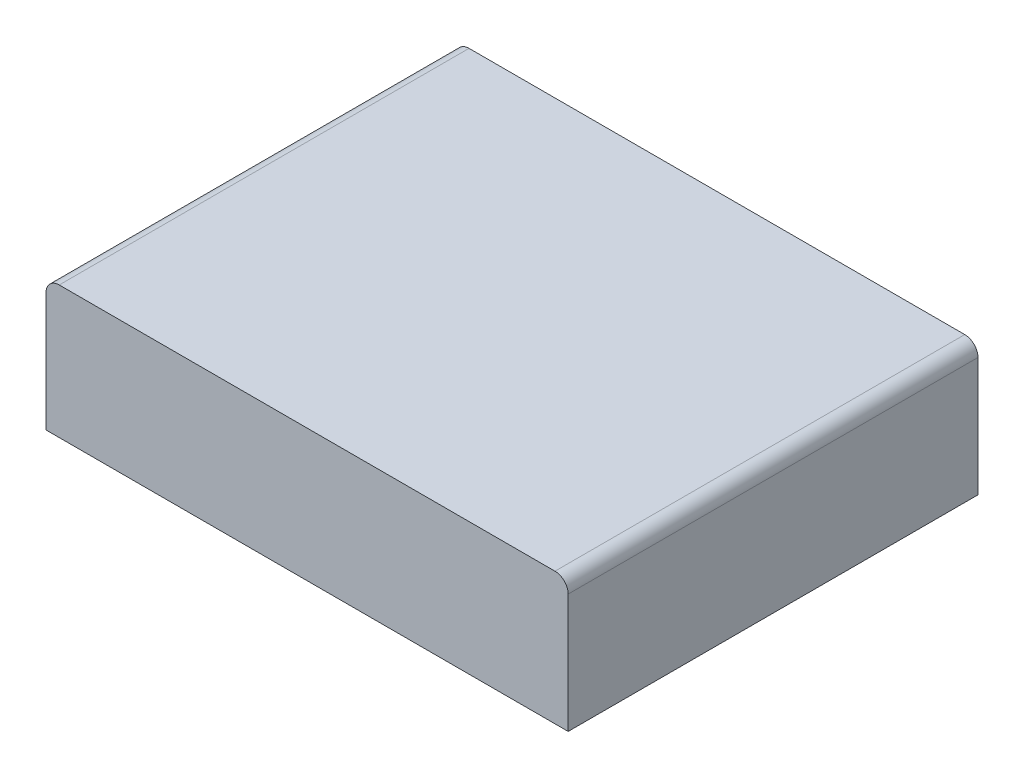
ISO-10303-21;
HEADER;
FILE_DESCRIPTION(('STEP AP214'),'2;1');
FILE_NAME('part.step','',(''),(''),'','','');
FILE_SCHEMA(('AUTOMOTIVE_DESIGN { 1 0 10303 214 1 1 1 1 }'));
ENDSEC;
DATA;
#1=APPLICATION_CONTEXT('core data for automotive mechanical design processes');
#2=APPLICATION_PROTOCOL_DEFINITION('international standard','automotive_design',2000,#1);
#3=PRODUCT_CONTEXT('',#1,'mechanical');
#4=PRODUCT('Part','Part','',(#3));
#5=PRODUCT_RELATED_PRODUCT_CATEGORY('part','',(#4));
#6=PRODUCT_DEFINITION_FORMATION('','',#4);
#7=PRODUCT_DEFINITION_CONTEXT('part definition',#1,'design');
#8=PRODUCT_DEFINITION('design','',#6,#7);
#9=PRODUCT_DEFINITION_SHAPE('','',#8);
#10=(LENGTH_UNIT() NAMED_UNIT(*) SI_UNIT(.MILLI.,.METRE.));
#11=(NAMED_UNIT(*) PLANE_ANGLE_UNIT() SI_UNIT($,.RADIAN.));
#12=(NAMED_UNIT(*) SI_UNIT($,.STERADIAN.) SOLID_ANGLE_UNIT());
#13=UNCERTAINTY_MEASURE_WITH_UNIT(LENGTH_MEASURE(1.E-05),#10,'distance_accuracy_value','');
#14=(GEOMETRIC_REPRESENTATION_CONTEXT(3) GLOBAL_UNCERTAINTY_ASSIGNED_CONTEXT((#13)) GLOBAL_UNIT_ASSIGNED_CONTEXT((#10,
#11,#12)) REPRESENTATION_CONTEXT('',''));
#15=CARTESIAN_POINT('',(0.,0.,0.));
#16=DIRECTION('',(0.,0.,1.));
#17=DIRECTION('',(1.,0.,0.));
#18=AXIS2_PLACEMENT_3D('',#15,#16,#17);
#19=CARTESIAN_POINT('',(5.64322874991416,39.1976983767566,241.582925809299));
#20=DIRECTION('',(0.,0.,1.));
#21=DIRECTION('',(1.,0.,0.));
#22=AXIS2_PLACEMENT_3D('',#19,#20,#21);
#23=CYLINDRICAL_SURFACE('',#22,0.0508);
#24=CARTESIAN_POINT('',(5.64322874991416,39.1976983767566,240.795525809299));
#25=DIRECTION('',(0.,0.,1.));
#26=DIRECTION('',(1.,0.,0.));
#27=AXIS2_PLACEMENT_3D('',#24,#25,#26);
#28=CIRCLE('',#27,0.0508);
#29=CARTESIAN_POINT('',(5.64322874991416,39.2484983767566,240.795525809299));
#30=VERTEX_POINT('',#29);
#31=CARTESIAN_POINT('',(5.59242874991414,39.1976983767566,240.795525809299));
#32=VERTEX_POINT('',#31);
#33=EDGE_CURVE('E126',#30,#32,#28,.T.);
#34=ORIENTED_EDGE('',*,*,#33,.T.);
#35=DIRECTION('',(0.,0.,-1.));
#36=VECTOR('',#35,1.);
#37=CARTESIAN_POINT('',(5.59242874991414,39.1976983767566,242.370325809298));
#38=LINE('',#37,#36);
#39=CARTESIAN_POINT('',(5.59242874991414,39.1976983767566,242.370325809298));
#40=VERTEX_POINT('',#39);
#41=EDGE_CURVE('E108',#32,#40,#38,.F.);
#42=ORIENTED_EDGE('',*,*,#41,.T.);
#43=CARTESIAN_POINT('',(5.64322874991416,39.1976983767566,242.370325809298));
#44=DIRECTION('',(0.,0.,1.));
#45=DIRECTION('',(1.,0.,0.));
#46=AXIS2_PLACEMENT_3D('',#43,#44,#45);
#47=CIRCLE('',#46,0.0508);
#48=CARTESIAN_POINT('',(5.64322874991416,39.2484983767566,242.370325809298));
#49=VERTEX_POINT('',#48);
#50=EDGE_CURVE('E20',#40,#49,#47,.F.);
#51=ORIENTED_EDGE('',*,*,#50,.T.);
#52=DIRECTION('',(0.,0.,-1.));
#53=VECTOR('',#52,1.);
#54=CARTESIAN_POINT('',(5.64322874991416,39.2484983767566,241.582925809299));
#55=LINE('',#54,#53);
#56=EDGE_CURVE('E104',#49,#30,#55,.T.);
#57=ORIENTED_EDGE('',*,*,#56,.T.);
#58=EDGE_LOOP('',(#34,#42,#51,#57));
#59=FACE_BOUND('',#58,.T.);
#60=ADVANCED_FACE('F17',(#59),#23,.T.);
#61=CARTESIAN_POINT('',(7.54822874991415,39.1976983767566,241.582925809299));
#62=DIRECTION('',(0.,0.,-1.));
#63=DIRECTION('',(-1.,0.,0.));
#64=AXIS2_PLACEMENT_3D('',#61,#62,#63);
#65=CYLINDRICAL_SURFACE('',#64,0.0508);
#66=CARTESIAN_POINT('',(7.54822874991415,39.1976983767566,242.370325809298));
#67=DIRECTION('',(0.,0.,-1.));
#68=DIRECTION('',(-1.,0.,0.));
#69=AXIS2_PLACEMENT_3D('',#66,#67,#68);
#70=CIRCLE('',#69,0.0508);
#71=CARTESIAN_POINT('',(7.54822874991415,39.2484983767566,242.370325809298));
#72=VERTEX_POINT('',#71);
#73=CARTESIAN_POINT('',(7.59902874991417,39.1976983767566,242.370325809298));
#74=VERTEX_POINT('',#73);
#75=EDGE_CURVE('E113',#72,#74,#70,.T.);
#76=ORIENTED_EDGE('',*,*,#75,.T.);
#77=DIRECTION('',(0.,0.,1.));
#78=VECTOR('',#77,1.);
#79=CARTESIAN_POINT('',(7.59902874991417,39.1976983767566,242.370325809298));
#80=LINE('',#79,#78);
#81=CARTESIAN_POINT('',(7.59902874991417,39.1976983767566,240.795525809299));
#82=VERTEX_POINT('',#81);
#83=EDGE_CURVE('E100',#74,#82,#80,.F.);
#84=ORIENTED_EDGE('',*,*,#83,.T.);
#85=CARTESIAN_POINT('',(7.54822874991415,39.1976983767566,240.795525809299));
#86=DIRECTION('',(0.,0.,-1.));
#87=DIRECTION('',(-1.,0.,0.));
#88=AXIS2_PLACEMENT_3D('',#85,#86,#87);
#89=CIRCLE('',#88,0.0508);
#90=CARTESIAN_POINT('',(7.54822874991415,39.2484983767566,240.795525809299));
#91=VERTEX_POINT('',#90);
#92=EDGE_CURVE('E122',#82,#91,#89,.F.);
#93=ORIENTED_EDGE('',*,*,#92,.T.);
#94=DIRECTION('',(0.,0.,-1.));
#95=VECTOR('',#94,1.);
#96=CARTESIAN_POINT('',(7.54822874991415,39.2484983767566,241.582925809299));
#97=LINE('',#96,#95);
#98=EDGE_CURVE('E109',#91,#72,#97,.F.);
#99=ORIENTED_EDGE('',*,*,#98,.T.);
#100=EDGE_LOOP('',(#76,#84,#93,#99));
#101=FACE_BOUND('',#100,.T.);
#102=ADVANCED_FACE('F161',(#101),#65,.T.);
#103=CARTESIAN_POINT('',(6.59572874991415,39.2484983767566,241.582925809299));
#104=DIRECTION('',(0.,-1.,0.));
#105=DIRECTION('',(0.,0.,-1.));
#106=AXIS2_PLACEMENT_3D('',#103,#104,#105);
#107=PLANE('',#106);
#108=DIRECTION('',(-1.,0.,0.));
#109=VECTOR('',#108,1.);
#110=CARTESIAN_POINT('',(5.59242874991414,39.2484983767566,242.370325809298));
#111=LINE('',#110,#109);
#112=EDGE_CURVE('E136',#49,#72,#111,.F.);
#113=ORIENTED_EDGE('',*,*,#112,.T.);
#114=ORIENTED_EDGE('',*,*,#98,.F.);
#115=DIRECTION('',(1.,0.,0.));
#116=VECTOR('',#115,1.);
#117=CARTESIAN_POINT('',(5.59242874991414,39.2484983767566,240.795525809299));
#118=LINE('',#117,#116);
#119=EDGE_CURVE('E117',#91,#30,#118,.F.);
#120=ORIENTED_EDGE('',*,*,#119,.T.);
#121=ORIENTED_EDGE('',*,*,#56,.F.);
#122=EDGE_LOOP('',(#113,#114,#120,#121));
#123=FACE_BOUND('',#122,.T.);
#124=ADVANCED_FACE('F134',(#123),#107,.F.);
#125=CARTESIAN_POINT('',(5.59242874991414,39.2484983767566,242.370325809298));
#126=DIRECTION('',(1.,0.,0.));
#127=DIRECTION('',(0.,0.,-1.));
#128=AXIS2_PLACEMENT_3D('',#125,#126,#127);
#129=PLANE('',#128);
#130=DIRECTION('',(0.,1.,0.));
#131=VECTOR('',#130,1.);
#132=CARTESIAN_POINT('',(5.59242874991414,39.2484983767566,240.795525809299));
#133=LINE('',#132,#131);
#134=CARTESIAN_POINT('',(5.59242874991414,38.7404983767566,240.795525809299));
#135=VERTEX_POINT('',#134);
#136=EDGE_CURVE('E79',#32,#135,#133,.F.);
#137=ORIENTED_EDGE('',*,*,#136,.T.);
#138=DIRECTION('',(0.,0.,-1.));
#139=VECTOR('',#138,1.);
#140=CARTESIAN_POINT('',(5.59242874991414,38.7404983767566,241.582925809299));
#141=LINE('',#140,#139);
#142=CARTESIAN_POINT('',(5.59242874991414,38.7404983767566,242.370325809298));
#143=VERTEX_POINT('',#142);
#144=EDGE_CURVE('E74',#143,#135,#141,.T.);
#145=ORIENTED_EDGE('',*,*,#144,.F.);
#146=DIRECTION('',(0.,1.,0.));
#147=VECTOR('',#146,1.);
#148=CARTESIAN_POINT('',(5.59242874991414,39.2484983767566,242.370325809298));
#149=LINE('',#148,#147);
#150=EDGE_CURVE('E77',#143,#40,#149,.T.);
#151=ORIENTED_EDGE('',*,*,#150,.T.);
#152=ORIENTED_EDGE('',*,*,#41,.F.);
#153=EDGE_LOOP('',(#137,#145,#151,#152));
#154=FACE_BOUND('',#153,.T.);
#155=ADVANCED_FACE('F75',(#154),#129,.F.);
#156=CARTESIAN_POINT('',(5.59242874991414,39.2484983767566,240.795525809299));
#157=DIRECTION('',(0.,0.,1.));
#158=DIRECTION('',(1.,0.,0.));
#159=AXIS2_PLACEMENT_3D('',#156,#157,#158);
#160=PLANE('',#159);
#161=ORIENTED_EDGE('',*,*,#119,.F.);
#162=ORIENTED_EDGE('',*,*,#92,.F.);
#163=DIRECTION('',(0.,1.,0.));
#164=VECTOR('',#163,1.);
#165=CARTESIAN_POINT('',(7.59902874991417,39.2484983767566,240.795525809299));
#166=LINE('',#165,#164);
#167=CARTESIAN_POINT('',(7.59902874991417,38.7404983767566,240.795525809299));
#168=VERTEX_POINT('',#167);
#169=EDGE_CURVE('E114',#82,#168,#166,.F.);
#170=ORIENTED_EDGE('',*,*,#169,.T.);
#171=DIRECTION('',(1.,0.,0.));
#172=VECTOR('',#171,1.);
#173=CARTESIAN_POINT('',(6.59572874991415,38.7404983767566,240.795525809299));
#174=LINE('',#173,#172);
#175=EDGE_CURVE('E84',#135,#168,#174,.T.);
#176=ORIENTED_EDGE('',*,*,#175,.F.);
#177=ORIENTED_EDGE('',*,*,#136,.F.);
#178=ORIENTED_EDGE('',*,*,#33,.F.);
#179=EDGE_LOOP('',(#161,#162,#170,#176,#177,#178));
#180=FACE_BOUND('',#179,.T.);
#181=ADVANCED_FACE('F164',(#180),#160,.F.);
#182=CARTESIAN_POINT('',(7.59902874991417,39.2484983767566,242.370325809298));
#183=DIRECTION('',(-1.,0.,0.));
#184=DIRECTION('',(0.,0.,1.));
#185=AXIS2_PLACEMENT_3D('',#182,#183,#184);
#186=PLANE('',#185);
#187=DIRECTION('',(0.,1.,0.));
#188=VECTOR('',#187,1.);
#189=CARTESIAN_POINT('',(7.59902874991417,39.2484983767566,242.370325809298));
#190=LINE('',#189,#188);
#191=CARTESIAN_POINT('',(7.59902874991417,38.7404983767566,242.370325809298));
#192=VERTEX_POINT('',#191);
#193=EDGE_CURVE('E36',#74,#192,#190,.F.);
#194=ORIENTED_EDGE('',*,*,#193,.T.);
#195=DIRECTION('',(0.,0.,-1.));
#196=VECTOR('',#195,1.);
#197=CARTESIAN_POINT('',(7.59902874991417,38.7404983767566,241.582925809299));
#198=LINE('',#197,#196);
#199=EDGE_CURVE('E27',#168,#192,#198,.F.);
#200=ORIENTED_EDGE('',*,*,#199,.F.);
#201=ORIENTED_EDGE('',*,*,#169,.F.);
#202=ORIENTED_EDGE('',*,*,#83,.F.);
#203=EDGE_LOOP('',(#194,#200,#201,#202));
#204=FACE_BOUND('',#203,.T.);
#205=ADVANCED_FACE('F162',(#204),#186,.F.);
#206=CARTESIAN_POINT('',(5.59242874991414,39.2484983767566,242.370325809298));
#207=DIRECTION('',(0.,0.,-1.));
#208=DIRECTION('',(-1.,0.,0.));
#209=AXIS2_PLACEMENT_3D('',#206,#207,#208);
#210=PLANE('',#209);
#211=ORIENTED_EDGE('',*,*,#150,.F.);
#212=DIRECTION('',(1.,0.,0.));
#213=VECTOR('',#212,1.);
#214=CARTESIAN_POINT('',(6.59572874991415,38.7404983767566,242.370325809298));
#215=LINE('',#214,#213);
#216=EDGE_CURVE('E11',#192,#143,#215,.F.);
#217=ORIENTED_EDGE('',*,*,#216,.F.);
#218=ORIENTED_EDGE('',*,*,#193,.F.);
#219=ORIENTED_EDGE('',*,*,#75,.F.);
#220=ORIENTED_EDGE('',*,*,#112,.F.);
#221=ORIENTED_EDGE('',*,*,#50,.F.);
#222=EDGE_LOOP('',(#211,#217,#218,#219,#220,#221));
#223=FACE_BOUND('',#222,.T.);
#224=ADVANCED_FACE('F86',(#223),#210,.F.);
#225=CARTESIAN_POINT('',(6.59572874991415,38.7404983767566,241.582925809299));
#226=DIRECTION('',(0.,-1.,0.));
#227=DIRECTION('',(0.,0.,-1.));
#228=AXIS2_PLACEMENT_3D('',#225,#226,#227);
#229=PLANE('',#228);
#230=ORIENTED_EDGE('',*,*,#199,.T.);
#231=ORIENTED_EDGE('',*,*,#216,.T.);
#232=ORIENTED_EDGE('',*,*,#144,.T.);
#233=ORIENTED_EDGE('',*,*,#175,.T.);
#234=EDGE_LOOP('',(#230,#231,#232,#233));
#235=FACE_BOUND('',#234,.T.);
#236=ADVANCED_FACE('F90',(#235),#229,.T.);
#237=CLOSED_SHELL('',(#60,#102,#124,#155,#181,#205,#224,#236));
#238=MANIFOLD_SOLID_BREP('B1',#237);
#239=ADVANCED_BREP_SHAPE_REPRESENTATION('',(#18,#238),#14);
#240=SHAPE_DEFINITION_REPRESENTATION(#9,#239);
ENDSEC;
END-ISO-10303-21;
